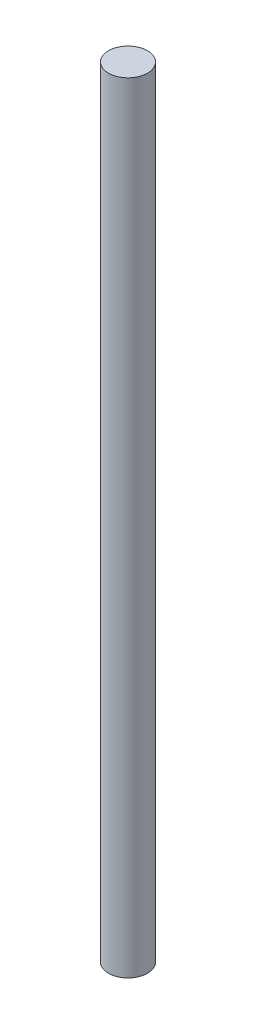
ISO-10303-21;
HEADER;
FILE_DESCRIPTION(('STEP AP214'),'2;1');
FILE_NAME('part.step','',(''),(''),'','','');
FILE_SCHEMA(('AUTOMOTIVE_DESIGN { 1 0 10303 214 1 1 1 1 }'));
ENDSEC;
DATA;
#1=APPLICATION_CONTEXT('core data for automotive mechanical design processes');
#2=APPLICATION_PROTOCOL_DEFINITION('international standard','automotive_design',2000,#1);
#3=PRODUCT_CONTEXT('',#1,'mechanical');
#4=PRODUCT('Part','Part','',(#3));
#5=PRODUCT_RELATED_PRODUCT_CATEGORY('part','',(#4));
#6=PRODUCT_DEFINITION_FORMATION('','',#4);
#7=PRODUCT_DEFINITION_CONTEXT('part definition',#1,'design');
#8=PRODUCT_DEFINITION('design','',#6,#7);
#9=PRODUCT_DEFINITION_SHAPE('','',#8);
#10=(LENGTH_UNIT() NAMED_UNIT(*) SI_UNIT(.MILLI.,.METRE.));
#11=(NAMED_UNIT(*) PLANE_ANGLE_UNIT() SI_UNIT($,.RADIAN.));
#12=(NAMED_UNIT(*) SI_UNIT($,.STERADIAN.) SOLID_ANGLE_UNIT());
#13=UNCERTAINTY_MEASURE_WITH_UNIT(LENGTH_MEASURE(1.E-05),#10,'distance_accuracy_value','');
#14=(GEOMETRIC_REPRESENTATION_CONTEXT(3) GLOBAL_UNCERTAINTY_ASSIGNED_CONTEXT((#13)) GLOBAL_UNIT_ASSIGNED_CONTEXT((#10,
#11,#12)) REPRESENTATION_CONTEXT('',''));
#15=CARTESIAN_POINT('',(0.,0.,0.));
#16=DIRECTION('',(0.,0.,1.));
#17=DIRECTION('',(1.,0.,0.));
#18=AXIS2_PLACEMENT_3D('',#15,#16,#17);
#19=CARTESIAN_POINT('',(0.,40.,0.));
#20=DIRECTION('',(0.,-1.,0.));
#21=DIRECTION('',(0.,0.,-1.));
#22=AXIS2_PLACEMENT_3D('',#19,#20,#21);
#23=CYLINDRICAL_SURFACE('',#22,1.);
#24=CARTESIAN_POINT('',(0.,40.,0.));
#25=DIRECTION('',(0.,1.,0.));
#26=DIRECTION('',(0.,0.,1.));
#27=AXIS2_PLACEMENT_3D('',#24,#25,#26);
#28=CIRCLE('',#27,1.);
#29=CARTESIAN_POINT('',(0.,40.,1.));
#30=VERTEX_POINT('',#29);
#31=EDGE_CURVE('E10',#30,#30,#28,.T.);
#32=ORIENTED_EDGE('',*,*,#31,.F.);
#33=EDGE_LOOP('',(#32));
#34=FACE_BOUND('',#33,.T.);
#35=CARTESIAN_POINT('',(0.,0.,0.));
#36=DIRECTION('',(0.,1.,0.));
#37=DIRECTION('',(0.,0.,1.));
#38=AXIS2_PLACEMENT_3D('',#35,#36,#37);
#39=CIRCLE('',#38,1.);
#40=CARTESIAN_POINT('',(0.,0.,1.));
#41=VERTEX_POINT('',#40);
#42=EDGE_CURVE('E34',#41,#41,#39,.T.);
#43=ORIENTED_EDGE('',*,*,#42,.T.);
#44=EDGE_LOOP('',(#43));
#45=FACE_BOUND('',#44,.T.);
#46=ADVANCED_FACE('F31',(#34,#45),#23,.T.);
#47=CARTESIAN_POINT('',(0.,40.,0.));
#48=DIRECTION('',(0.,1.,0.));
#49=DIRECTION('',(0.,0.,1.));
#50=AXIS2_PLACEMENT_3D('',#47,#48,#49);
#51=PLANE('',#50);
#52=ORIENTED_EDGE('',*,*,#31,.T.);
#53=EDGE_LOOP('',(#52));
#54=FACE_BOUND('',#53,.T.);
#55=ADVANCED_FACE('F46',(#54),#51,.T.);
#56=CARTESIAN_POINT('',(0.,0.,0.));
#57=DIRECTION('',(0.,1.,0.));
#58=DIRECTION('',(0.,0.,1.));
#59=AXIS2_PLACEMENT_3D('',#56,#57,#58);
#60=PLANE('',#59);
#61=ORIENTED_EDGE('',*,*,#42,.F.);
#62=EDGE_LOOP('',(#61));
#63=FACE_BOUND('',#62,.T.);
#64=ADVANCED_FACE('F44',(#63),#60,.F.);
#65=CLOSED_SHELL('',(#46,#55,#64));
#66=MANIFOLD_SOLID_BREP('B2',#65);
#67=ADVANCED_BREP_SHAPE_REPRESENTATION('',(#18,#66),#14);
#68=SHAPE_DEFINITION_REPRESENTATION(#9,#67);
ENDSEC;
END-ISO-10303-21;
